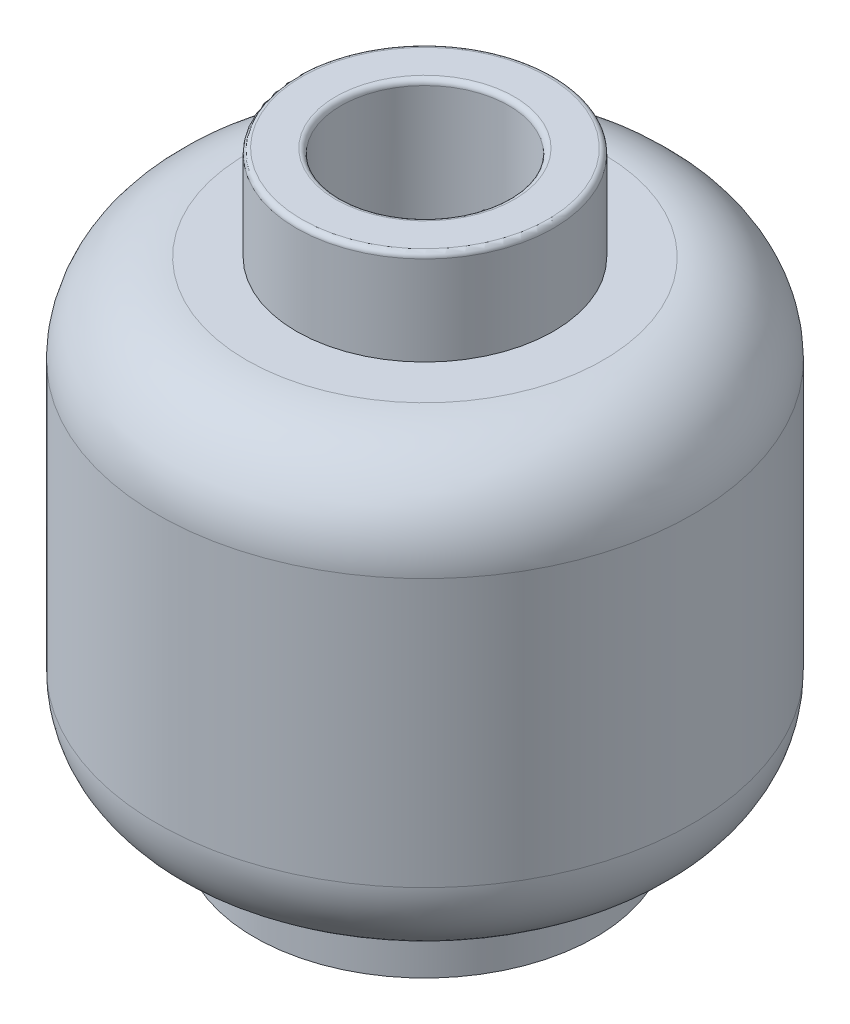
ISO-10303-21;
HEADER;
FILE_DESCRIPTION(('STEP AP214'),'2;1');
FILE_NAME('part.step','',(''),(''),'','','');
FILE_SCHEMA(('AUTOMOTIVE_DESIGN { 1 0 10303 214 1 1 1 1 }'));
ENDSEC;
DATA;
#1=APPLICATION_CONTEXT('core data for automotive mechanical design processes');
#2=APPLICATION_PROTOCOL_DEFINITION('international standard','automotive_design',2000,#1);
#3=PRODUCT_CONTEXT('',#1,'mechanical');
#4=PRODUCT('Part','Part','',(#3));
#5=PRODUCT_RELATED_PRODUCT_CATEGORY('part','',(#4));
#6=PRODUCT_DEFINITION_FORMATION('','',#4);
#7=PRODUCT_DEFINITION_CONTEXT('part definition',#1,'design');
#8=PRODUCT_DEFINITION('design','',#6,#7);
#9=PRODUCT_DEFINITION_SHAPE('','',#8);
#10=(LENGTH_UNIT() NAMED_UNIT(*) SI_UNIT(.MILLI.,.METRE.));
#11=(NAMED_UNIT(*) PLANE_ANGLE_UNIT() SI_UNIT($,.RADIAN.));
#12=(NAMED_UNIT(*) SI_UNIT($,.STERADIAN.) SOLID_ANGLE_UNIT());
#13=UNCERTAINTY_MEASURE_WITH_UNIT(LENGTH_MEASURE(1.E-05),#10,'distance_accuracy_value','');
#14=(GEOMETRIC_REPRESENTATION_CONTEXT(3) GLOBAL_UNCERTAINTY_ASSIGNED_CONTEXT((#13)) GLOBAL_UNIT_ASSIGNED_CONTEXT((#10,
#11,#12)) REPRESENTATION_CONTEXT('',''));
#15=CARTESIAN_POINT('',(0.,0.,0.));
#16=DIRECTION('',(0.,0.,1.));
#17=DIRECTION('',(1.,0.,0.));
#18=AXIS2_PLACEMENT_3D('',#15,#16,#17);
#19=CARTESIAN_POINT('',(0.,0.,0.));
#20=DIRECTION('',(0.,-1.,0.));
#21=DIRECTION('',(0.,0.,-1.));
#22=AXIS2_PLACEMENT_3D('',#19,#20,#21);
#23=CYLINDRICAL_SURFACE('',#22,5.1);
#24=CARTESIAN_POINT('',(1.,5.8,-5.00099990001999));
#25=CARTESIAN_POINT('',(1.00000151690153,5.765488161563,-5.00099990712764));
#26=CARTESIAN_POINT('',(1.00286876052158,5.7309536411149,-5.00042890994423));
#27=CARTESIAN_POINT('',(1.01425646627887,5.66284306685978,-4.99813127779737));
#28=CARTESIAN_POINT('',(1.02278306702181,5.62926809515179,-4.99640338795485));
#29=CARTESIAN_POINT('',(1.04521458875839,5.56407423631433,-4.99175889029626));
#30=CARTESIAN_POINT('',(1.05911613407239,5.53245413587622,-4.98884302851232));
#31=CARTESIAN_POINT('',(1.09185026684241,5.47204175159411,-4.98178100126432));
#32=CARTESIAN_POINT('',(1.11068171939305,5.44324881900771,-4.97763511893192));
#33=CARTESIAN_POINT('',(1.15277623531479,5.38913485922336,-4.96805530875786));
#34=CARTESIAN_POINT('',(1.17605952865221,5.36383062546025,-4.96261547229567));
#35=CARTESIAN_POINT('',(1.22626351158888,5.31750525096138,-4.9504488375796));
#36=CARTESIAN_POINT('',(1.25318449775082,5.29648445978382,-4.94372193437907));
#37=CARTESIAN_POINT('',(1.31032858774834,5.25889309157359,-4.92888668070293));
#38=CARTESIAN_POINT('',(1.34060084855158,5.24240598579846,-4.92075640207097));
#39=CARTESIAN_POINT('',(1.40313946905718,5.21470244708467,-4.90329006920268));
#40=CARTESIAN_POINT('',(1.43540611634181,5.2034867762807,-4.89395384086088));
#41=CARTESIAN_POINT('',(1.50214797051841,5.18619141160312,-4.87389020382693));
#42=CARTESIAN_POINT('',(1.53666096976907,5.18030042707963,-4.86312614436147));
#43=CARTESIAN_POINT('',(1.6058968164829,5.17432566475203,-4.84070457142229));
#44=CARTESIAN_POINT('',(1.64061971138439,5.17424325286651,-4.82904684844376));
#45=CARTESIAN_POINT('',(1.71101143225061,5.17989411128676,-4.80456989248105));
#46=CARTESIAN_POINT('',(1.74664840079208,5.18589992680315,-4.79172183174764));
#47=CARTESIAN_POINT('',(1.81628042291799,5.20390358015892,-4.7657641451245));
#48=CARTESIAN_POINT('',(1.85027501952491,5.215903075283,-4.75265444785392));
#49=CARTESIAN_POINT('',(1.91694272819715,5.24612177724516,-4.72616784257355));
#50=CARTESIAN_POINT('',(1.94952527278676,5.26454782710356,-4.71279811486468));
#51=CARTESIAN_POINT('',(2.01110344261868,5.30710066254025,-4.68685188814152));
#52=CARTESIAN_POINT('',(2.04009866749996,5.33122808354438,-4.67427547774163));
#53=CARTESIAN_POINT('',(2.09319922337433,5.38430308500256,-4.65073651527793));
#54=CARTESIAN_POINT('',(2.1173665136775,5.41317955159165,-4.63975408682706));
#55=CARTESIAN_POINT('',(2.16036994898472,5.47530251745684,-4.61988795561478));
#56=CARTESIAN_POINT('',(2.17920930829465,5.50854636411416,-4.61100298800605));
#57=CARTESIAN_POINT('',(2.20941882839442,5.57566770058096,-4.59659956061495));
#58=CARTESIAN_POINT('',(2.22126265230069,5.60928611707891,-4.59087008544554));
#59=CARTESIAN_POINT('',(2.23908788005507,5.67838137952327,-4.58220318037648));
#60=CARTESIAN_POINT('',(2.24507374341309,5.71385679008005,-4.57926362663521));
#61=CARTESIAN_POINT('',(2.25059255570592,5.78209364732076,-4.57655336681333));
#62=CARTESIAN_POINT('',(2.25067299386433,5.81480129048918,-4.57651380446295));
#63=CARTESIAN_POINT('',(2.24574719214254,5.87973293671201,-4.57893296336695));
#64=CARTESIAN_POINT('',(2.24074178733327,5.91195701828346,-4.58139127448252));
#65=CARTESIAN_POINT('',(2.22608462579069,5.9741098120134,-4.58853031334332));
#66=CARTESIAN_POINT('',(2.21656498636765,6.00407733617531,-4.59314779857097));
#67=CARTESIAN_POINT('',(2.19331529867523,6.06194597288415,-4.60429509999727));
#68=CARTESIAN_POINT('',(2.17958445730978,6.08984669496015,-4.61082527640283));
#69=CARTESIAN_POINT('',(2.14751640124844,6.14446916798602,-4.62585155734728));
#70=CARTESIAN_POINT('',(2.12896763856847,6.17104204151082,-4.63443592664681));
#71=CARTESIAN_POINT('',(2.08827515536961,6.22075425701481,-4.65291370695865));
#72=CARTESIAN_POINT('',(2.06613005649317,6.24389227599294,-4.6628076196059));
#73=CARTESIAN_POINT('',(2.01661947702173,6.28832916512279,-4.68444661193492));
#74=CARTESIAN_POINT('',(1.98896042974994,6.30925906288479,-4.69627827255092));
#75=CARTESIAN_POINT('',(1.93075163098336,6.3461961737034,-4.72050766328082));
#76=CARTESIAN_POINT('',(1.90020077240919,6.36220149142229,-4.73290560923961));
#77=CARTESIAN_POINT('',(1.83468606470461,6.38992287272182,-4.7587025671708));
#78=CARTESIAN_POINT('',(1.79956293002442,6.40125601052133,-4.77211042099349));
#79=CARTESIAN_POINT('',(1.72774336013291,6.41759640939499,-4.79857974928233));
#80=CARTESIAN_POINT('',(1.69104671714969,6.4226028323901,-4.81164117763434));
#81=CARTESIAN_POINT('',(1.61664596965983,6.42606514822672,-4.83714990055694));
#82=CARTESIAN_POINT('',(1.57893511386604,6.42444426832042,-4.84958829808962));
#83=CARTESIAN_POINT('',(1.50407182859973,6.41435083951856,-4.8733262954358));
#84=CARTESIAN_POINT('',(1.46691928529337,6.40587970716359,-4.88462613014563));
#85=CARTESIAN_POINT('',(1.39576310243052,6.38260128501554,-4.9054224592002));
#86=CARTESIAN_POINT('',(1.36169374671174,6.36804124449935,-4.9149703759735));
#87=CARTESIAN_POINT('',(1.29638270127521,6.33292492635012,-4.93259935455761));
#88=CARTESIAN_POINT('',(1.26514011132263,6.3123705665862,-4.94068088419624));
#89=CARTESIAN_POINT('',(1.20800798557652,6.26691704995019,-4.95495150096601));
#90=CARTESIAN_POINT('',(1.1819342574582,6.24227174123747,-4.96121244028701));
#91=CARTESIAN_POINT('',(1.13426011235918,6.1886957942133,-4.97232890416605));
#92=CARTESIAN_POINT('',(1.11265989194766,6.15976496768885,-4.97718436697015));
#93=CARTESIAN_POINT('',(1.07529307207803,6.09944464528376,-4.98538869981984));
#94=CARTESIAN_POINT('',(1.05936427945246,6.06816117676783,-4.9887801739823));
#95=CARTESIAN_POINT('',(1.032954651942,6.00329884162395,-4.99431561319897));
#96=CARTESIAN_POINT('',(1.02246725616904,5.96972279480244,-4.99646108098231));
#97=CARTESIAN_POINT('',(1.00993089238961,5.9132885055672,-4.99900623651242));
#98=CARTESIAN_POINT('',(1.00621232443705,5.89080217040606,-4.99975431794545));
#99=CARTESIAN_POINT('',(1.00124638691545,5.84554718238663,-5.00075114548123));
#100=CARTESIAN_POINT('',(0.999998998813423,5.8227785316469,-5.0009998953288));
#101=CARTESIAN_POINT('',(1.,5.8,-5.00099990001999));
#102=B_SPLINE_CURVE_WITH_KNOTS('',3,(#24,#25,#26,#27,#28,#29,#30,#31,#32,#33,#34,#35,#36,#37,
#38,#39,#40,#41,#42,#43,#44,#45,#46,#47,#48,#49,#50,#51,#52,#53,#54,#55,#56,#57,#58,#59,#60,#61,
#62,#63,#64,#65,#66,#67,#68,#69,#70,#71,#72,#73,#74,#75,#76,#77,#78,#79,#80,#81,#82,#83,#84,#85,
#86,#87,#88,#89,#90,#91,#92,#93,#94,#95,#96,#97,#98,#99,#100,#101),.UNSPECIFIED.,.T.,.F.,(4,2,2,
2,2,2,2,2,2,2,2,2,2,2,2,2,2,2,2,2,2,2,2,2,2,2,2,2,2,2,2,2,2,2,2,2,2,2,4),(0.,0.103452202013909,
0.207016800604948,0.310516461871601,0.413992317580975,0.517950069215874,0.621916301119246,
0.727684988413025,0.833468962855265,0.942869685506748,1.05229613426876,1.16684732578833,
1.28143020887799,1.40010567833363,1.51879438058107,1.63584516059708,1.75282517326617,
1.86053319153262,1.96815915061096,2.06579322859094,2.16341127811561,2.25833377892936,
2.35327416749598,2.4534281003628,2.55362050993002,2.66309505897257,2.77261168925676,
2.88986568072622,3.00713520281728,3.12576703788831,3.24437434775355,3.35857250437301,
3.47273416355636,3.58145331344499,3.69017723951884,3.79547959618473,3.90065468921569,
3.96893580773282,4.03721641416349),.UNSPECIFIED.);
#103=CARTESIAN_POINT('',(1.,5.8,-5.00099990001999));
#104=VERTEX_POINT('',#103);
#105=EDGE_CURVE('E222',#104,#104,#102,.T.);
#106=ORIENTED_EDGE('',*,*,#105,.T.);
#107=EDGE_LOOP('',(#106));
#108=FACE_BOUND('',#107,.T.);
#109=CARTESIAN_POINT('',(0.,7.89999999999999,0.));
#110=DIRECTION('',(0.,-1.,0.));
#111=DIRECTION('',(0.,0.,-1.));
#112=AXIS2_PLACEMENT_3D('',#109,#110,#111);
#113=CIRCLE('',#112,5.1);
#114=CARTESIAN_POINT('',(0.,7.89999999999999,-5.1));
#115=VERTEX_POINT('',#114);
#116=EDGE_CURVE('E201',#115,#115,#113,.T.);
#117=ORIENTED_EDGE('',*,*,#116,.T.);
#118=EDGE_LOOP('',(#117));
#119=FACE_BOUND('',#118,.T.);
#120=CARTESIAN_POINT('',(0.,2.80000000000001,0.));
#121=DIRECTION('',(0.,-1.,0.));
#122=DIRECTION('',(0.,0.,-1.));
#123=AXIS2_PLACEMENT_3D('',#120,#121,#122);
#124=CIRCLE('',#123,5.1);
#125=CARTESIAN_POINT('',(0.,2.80000000000001,-5.1));
#126=VERTEX_POINT('',#125);
#127=EDGE_CURVE('E204',#126,#126,#124,.T.);
#128=ORIENTED_EDGE('',*,*,#127,.F.);
#129=EDGE_LOOP('',(#128));
#130=FACE_BOUND('',#129,.T.);
#131=CARTESIAN_POINT('',(-2.25,5.8,-4.57684389071771));
#132=CARTESIAN_POINT('',(-2.24999821093017,5.76731910036945,-4.57684509570473));
#133=CARTESIAN_POINT('',(-2.24742352409958,5.73461510591976,-4.57811328492607));
#134=CARTESIAN_POINT('',(-2.23723923988095,5.67017253612192,-4.58309842089861));
#135=CARTESIAN_POINT('',(-2.2296236871884,5.63843514917436,-4.58681826402382));
#136=CARTESIAN_POINT('',(-2.20972563417215,5.57692449783731,-4.59643701994647));
#137=CARTESIAN_POINT('',(-2.19745714026951,5.54714565041975,-4.60232939146728));
#138=CARTESIAN_POINT('',(-2.16872735700625,5.49015356934849,-4.61593687371031));
#139=CARTESIAN_POINT('',(-2.15226598984845,5.46294038331251,-4.6236520182532));
#140=CARTESIAN_POINT('',(-2.11478116282377,5.41034270048599,-4.64092079738532));
#141=CARTESIAN_POINT('',(-2.09357355176423,5.38511335026666,-4.65054604251694));
#142=CARTESIAN_POINT('',(-2.04774396214306,5.33850026797738,-4.67090713008831));
#143=CARTESIAN_POINT('',(-2.02312072258144,5.31711796290786,-4.68164338232207));
#144=CARTESIAN_POINT('',(-1.96863294630213,5.27674561146904,-4.70483142166591));
#145=CARTESIAN_POINT('',(-1.93849385989209,5.25816371078624,-4.71734986328975));
#146=CARTESIAN_POINT('',(-1.8756221450062,5.22636637316565,-4.74269871488975));
#147=CARTESIAN_POINT('',(-1.8428885923984,5.21315285877143,-4.75552923488804));
#148=CARTESIAN_POINT('',(-1.77374872752115,5.19182379800837,-4.78176274034261));
#149=CARTESIAN_POINT('',(-1.73723941258804,5.18403073028752,-4.79515812651366));
#150=CARTESIAN_POINT('',(-1.66319810445617,5.17505486753469,-4.82133940079189));
#151=CARTESIAN_POINT('',(-1.62566609584257,5.17387217219489,-4.8341252797041));
#152=CARTESIAN_POINT('',(-1.55088062129565,5.17828782789798,-4.85863237780584));
#153=CARTESIAN_POINT('',(-1.51362678405204,5.18384770352537,-4.87035923138294));
#154=CARTESIAN_POINT('',(-1.44036847775789,5.20170542830229,-4.89252517813363));
#155=CARTESIAN_POINT('',(-1.40436368656999,5.21400152618944,-4.90296460514461));
#156=CARTESIAN_POINT('',(-1.33639539895269,5.24443090822323,-4.92191412051277));
#157=CARTESIAN_POINT('',(-1.30432354450727,5.26228157406131,-4.93048917679626));
#158=CARTESIAN_POINT('',(-1.2435654663394,5.30353267885378,-4.94616317050037));
#159=CARTESIAN_POINT('',(-1.21487835175153,5.32693165258872,-4.95326249671038));
#160=CARTESIAN_POINT('',(-1.16310412919168,5.37747463180253,-4.96566892599652));
#161=CARTESIAN_POINT('',(-1.13982463085653,5.40440565189765,-4.97104172369588));
#162=CARTESIAN_POINT('',(-1.09808908475715,5.46198590135321,-4.98042762525543));
#163=CARTESIAN_POINT('',(-1.07963229089318,5.49263455449922,-4.98444093946394));
#164=CARTESIAN_POINT('',(-1.04858778512332,5.55590315625201,-4.99106302869871));
#165=CARTESIAN_POINT('',(-1.03585885464257,5.58845033223833,-4.99370587652689));
#166=CARTESIAN_POINT('',(-1.01598778237418,5.6552793787839,-4.99778677372652));
#167=CARTESIAN_POINT('',(-1.0088452568402,5.68956113001789,-4.99922490585386));
#168=CARTESIAN_POINT('',(-1.00042397857505,5.75849380100035,-5.00091694997969));
#169=CARTESIAN_POINT('',(-0.999083597488843,5.79313690284205,-5.00118330864447));
#170=CARTESIAN_POINT('',(-1.00214002979624,5.86215840396103,-5.00057173712213));
#171=CARTESIAN_POINT('',(-1.00653668886168,5.89653681033366,-4.99969383771591));
#172=CARTESIAN_POINT('',(-1.02091046741958,5.9639714438645,-4.99677844163824));
#173=CARTESIAN_POINT('',(-1.03087468424415,5.99703053938868,-4.99474362589915));
#174=CARTESIAN_POINT('',(-1.05605752736804,6.06097963475024,-4.98947962611299));
#175=CARTESIAN_POINT('',(-1.07127610288315,6.0918696555486,-4.98625045360954));
#176=CARTESIAN_POINT('',(-1.10654472335407,6.15072806693755,-4.97854239136448));
#177=CARTESIAN_POINT('',(-1.12661116930954,6.17868606754598,-4.97405925097897));
#178=CARTESIAN_POINT('',(-1.1709086224938,6.23080849883774,-4.96381792715512));
#179=CARTESIAN_POINT('',(-1.19513973935135,6.25497282962632,-4.95805971015114));
#180=CARTESIAN_POINT('',(-1.247331635441,6.29917479847546,-4.94518893131065));
#181=CARTESIAN_POINT('',(-1.27533495137311,6.31915752788866,-4.93806045530358));
#182=CARTESIAN_POINT('',(-1.33396784273672,6.35415840439052,-4.92254494847851));
#183=CARTESIAN_POINT('',(-1.36459769549665,6.36917602641298,-4.914157784689));
#184=CARTESIAN_POINT('',(-1.42846052470691,6.39431229924919,-4.89598118116687));
#185=CARTESIAN_POINT('',(-1.46174208100307,6.40428388174009,-4.8861593593167));
#186=CARTESIAN_POINT('',(-1.52918127815087,6.41857313955832,-4.86547524519933));
#187=CARTESIAN_POINT('',(-1.56333910276756,6.42288961888816,-4.85461273335776));
#188=CARTESIAN_POINT('',(-1.63313206050846,6.42596461274787,-4.8315926381899));
#189=CARTESIAN_POINT('',(-1.66876640880608,6.42447155962433,-4.81939917861962));
#190=CARTESIAN_POINT('',(-1.73908614337535,6.41552141304417,-4.79447314128542));
#191=CARTESIAN_POINT('',(-1.77377127564805,6.40806273908869,-4.78174042149958));
#192=CARTESIAN_POINT('',(-1.84282835380547,6.38697161350419,-4.75556578085646));
#193=CARTESIAN_POINT('',(-1.87711962140943,6.37308236969646,-4.74211727490861));
#194=CARTESIAN_POINT('',(-1.94283937523909,6.33941335716951,-4.71557341915411));
#195=CARTESIAN_POINT('',(-1.97426728063138,6.31963239677358,-4.70247814137742));
#196=CARTESIAN_POINT('',(-2.0336243769326,6.27439996519604,-4.67711697517972));
#197=CARTESIAN_POINT('',(-2.06152093769916,6.24890090471902,-4.66485924465042));
#198=CARTESIAN_POINT('',(-2.11255598263187,6.19287213213909,-4.641970605721));
#199=CARTESIAN_POINT('',(-2.13569478139474,6.16234275289574,-4.63133958976979));
#200=CARTESIAN_POINT('',(-2.17509710786169,6.09888732174075,-4.61295998744394));
#201=CARTESIAN_POINT('',(-2.19167582030666,6.06619495935477,-4.60508224522269));
#202=CARTESIAN_POINT('',(-2.2189449995419,5.99798101696466,-4.5920055529927));
#203=CARTESIAN_POINT('',(-2.22964830953976,5.96246580378028,-4.58680076172451));
#204=CARTESIAN_POINT('',(-2.24139677682865,5.90548927883373,-4.58106549185679));
#205=CARTESIAN_POINT('',(-2.24461602880037,5.88455635483225,-4.57948736746911));
#206=CARTESIAN_POINT('',(-2.24891816697547,5.84241885521049,-4.57737620225752));
#207=CARTESIAN_POINT('',(-2.25000116134662,5.8212142933991,-4.57684310851928));
#208=CARTESIAN_POINT('',(-2.25,5.8,-4.57684389071771));
#209=B_SPLINE_CURVE_WITH_KNOTS('',3,(#131,#132,#133,#134,#135,#136,#137,#138,#139,#140,#141,
#142,#143,#144,#145,#146,#147,#148,#149,#150,#151,#152,#153,#154,#155,#156,#157,#158,#159,#160,
#161,#162,#163,#164,#165,#166,#167,#168,#169,#170,#171,#172,#173,#174,#175,#176,#177,#178,#179,
#180,#181,#182,#183,#184,#185,#186,#187,#188,#189,#190,#191,#192,#193,#194,#195,#196,#197,#198,
#199,#200,#201,#202,#203,#204,#205,#206,#207,#208),.UNSPECIFIED.,.T.,.F.,(4,2,2,2,2,2,2,2,2,2,2,
2,2,2,2,2,2,2,2,2,2,2,2,2,2,2,2,2,2,2,2,2,2,2,2,2,2,2,4),(0.,0.0979599375773447,
0.19603581257495,0.293818770289086,0.391603542461189,0.494184159702283,0.596802749499284,
0.708976625992396,0.821190639215509,0.939612702968072,1.05803655265971,1.1757878033801,
1.29350845600906,1.40601578351146,1.51849343265248,1.62596591030116,1.73342175149066,
1.83805966032882,1.94269038065466,2.046206979861,2.14972079449597,2.25299570765941,
2.35626962268268,2.45989794429762,2.56352899419188,2.66844555479928,2.77337320691538,
2.88120449766342,2.9890585899662,3.10163392771462,3.21423910043866,3.33179045133175,
3.4493655946871,3.56795819196073,3.68654294503193,3.79841103740179,3.91003361037509,
3.97362598739754,4.03721514438575),.UNSPECIFIED.);
#210=CARTESIAN_POINT('',(-2.25,5.8,-4.57684389071771));
#211=VERTEX_POINT('',#210);
#212=EDGE_CURVE('E231',#211,#211,#209,.T.);
#213=ORIENTED_EDGE('',*,*,#212,.T.);
#214=EDGE_LOOP('',(#213));
#215=FACE_BOUND('',#214,.T.);
#216=CARTESIAN_POINT('',(1.3,3.8713257982787,-4.93153120237518));
#217=CARTESIAN_POINT('',(1.22883332281746,3.84025830188964,-4.9503010426129));
#218=CARTESIAN_POINT('',(1.15624680790194,3.81162361149582,-4.96777829704287));
#219=CARTESIAN_POINT('',(1.00859894048655,3.75947413134989,-4.99984142214967));
#220=CARTESIAN_POINT('',(0.933536417027163,3.7359618052369,-5.01442590122403));
#221=CARTESIAN_POINT('',(0.78148598086778,3.69437327576793,-5.04035893931483));
#222=CARTESIAN_POINT('',(0.70450116508123,3.6762888715575,-5.05171237863539));
#223=CARTESIAN_POINT('',(0.549036662856893,3.64573002863894,-5.07096725218179));
#224=CARTESIAN_POINT('',(0.470557258612269,3.63325454164576,-5.07886933144565));
#225=CARTESIAN_POINT('',(0.233067920808665,3.60445195955051,-5.09713907659285));
#226=CARTESIAN_POINT('',(0.0724320076051236,3.59686583100802,-5.10199622901578));
#227=CARTESIAN_POINT('',(-0.247805023067229,3.60550042371304,-5.09649602655497));
#228=CARTESIAN_POINT('',(-0.40740644380972,3.62171381838022,-5.08614335394926));
#229=CARTESIAN_POINT('',(-0.691970459008257,3.67186552887662,-5.05447808188846));
#230=CARTESIAN_POINT('',(-0.817889278403212,3.70197996302855,-5.03554107236418));
#231=CARTESIAN_POINT('',(-1.002295936729,3.7577454478594,-5.00093281247279));
#232=CARTESIAN_POINT('',(-1.0630313708364,3.77810476219042,-4.98835976998436));
#233=CARTESIAN_POINT('',(-1.1828190741205,3.82221034597633,-4.9613214198173));
#234=CARTESIAN_POINT('',(-1.24187158850767,3.84595611894727,-4.94685638954605));
#235=CARTESIAN_POINT('',(-1.3,3.8713257982787,-4.93153120237518));
#236=B_SPLINE_CURVE_WITH_KNOTS('',3,(#216,#217,#218,#219,#220,#221,#222,#223,#224,#225,#226,
#227,#228,#229,#230,#231,#232,#233,#234,#235),.UNSPECIFIED.,.F.,.F.,(4,2,2,2,2,2,2,2,2,4),(0.,
0.239627551645458,0.479370100744524,0.718748586582787,0.958082314886314,1.43807358757161,
1.91791712800384,2.30919460846079,2.50491238933672,2.70060150574521),.UNSPECIFIED.);
#237=CARTESIAN_POINT('',(1.3,3.8713257982787,-4.93153120237518));
#238=VERTEX_POINT('',#237);
#239=CARTESIAN_POINT('',(-1.3,3.8713257982787,-4.93153120237518));
#240=VERTEX_POINT('',#239);
#241=EDGE_CURVE('E418',#238,#240,#236,.T.);
#242=ORIENTED_EDGE('',*,*,#241,.T.);
#243=CARTESIAN_POINT('',(-1.3,3.8713257982787,-4.93153120237518));
#244=CARTESIAN_POINT('',(-1.31338855499881,3.87718033566054,-4.92800444988738));
#245=CARTESIAN_POINT('',(-1.32724626058561,3.88182024482468,-4.92429066343492));
#246=CARTESIAN_POINT('',(-1.35546636870045,3.88862283021303,-4.91659613443181));
#247=CARTESIAN_POINT('',(-1.36982807650977,3.89078878821074,-4.91261575296989));
#248=CARTESIAN_POINT('',(-1.39865773341574,3.89261110622255,-4.90448597409676));
#249=CARTESIAN_POINT('',(-1.4131256627602,3.89226792157415,-4.90033660748744));
#250=CARTESIAN_POINT('',(-1.44177342141276,3.88910305721698,-4.8919844258077));
#251=CARTESIAN_POINT('',(-1.45595321387999,3.88628106258507,-4.88778160401288));
#252=CARTESIAN_POINT('',(-1.48383336196229,3.87817520551703,-4.87939070611529));
#253=CARTESIAN_POINT('',(-1.49752408921219,3.87285705856116,-4.87520368095601));
#254=CARTESIAN_POINT('',(-1.52381934455686,3.85987510464736,-4.86704882322635));
#255=CARTESIAN_POINT('',(-1.53642377446825,3.8522110859456,-4.86308101048079));
#256=CARTESIAN_POINT('',(-1.56005869486032,3.83479710124346,-4.85555039134661));
#257=CARTESIAN_POINT('',(-1.57110189506788,3.82506581472958,-4.85198436904747));
#258=CARTESIAN_POINT('',(-1.59137953242917,3.80372219427087,-4.84537151906874));
#259=CARTESIAN_POINT('',(-1.60061443790753,3.79211034879334,-4.842324556986));
#260=CARTESIAN_POINT('',(-1.61661890590952,3.76781348555749,-4.83700443330885));
#261=CARTESIAN_POINT('',(-1.62347112046003,3.75518860898471,-4.83470555898197));
#262=CARTESIAN_POINT('',(-1.63493844688864,3.72885678595348,-4.83083980027428));
#263=CARTESIAN_POINT('',(-1.63955431793703,3.71515020853945,-4.82927266749613));
#264=CARTESIAN_POINT('',(-1.64618855680821,3.68779502151544,-4.82701511754818));
#265=CARTESIAN_POINT('',(-1.64832685359242,3.67417876851477,-4.82628424528599));
#266=CARTESIAN_POINT('',(-1.65033571736966,3.64676167240988,-4.8255977081811));
#267=CARTESIAN_POINT('',(-1.65020676312933,3.63296086889152,-4.82564187967542));
#268=CARTESIAN_POINT('',(-1.6477252597125,3.60600338674792,-4.82648971819857));
#269=CARTESIAN_POINT('',(-1.64543927117247,3.59283978359029,-4.82727065053108));
#270=CARTESIAN_POINT('',(-1.63882421281158,3.56709992221351,-4.82952039869228));
#271=CARTESIAN_POINT('',(-1.6344952194092,3.55452364204491,-4.83098918879168));
#272=CARTESIAN_POINT('',(-1.62389488406982,3.53017429283383,-4.83456273197555));
#273=CARTESIAN_POINT('',(-1.61760564214158,3.51840989886383,-4.83667334131429));
#274=CARTESIAN_POINT('',(-1.60330090717389,3.49609956616153,-4.84143396333915));
#275=CARTESIAN_POINT('',(-1.59528460820921,3.48555419982646,-4.8440842278217));
#276=CARTESIAN_POINT('',(-1.577396735443,3.46550977301499,-4.84993935576414));
#277=CARTESIAN_POINT('',(-1.5674615453281,3.45607299098751,-4.8531627911077));
#278=CARTESIAN_POINT('',(-1.54627268664829,3.43900004721316,-4.85995509838232));
#279=CARTESIAN_POINT('',(-1.5350205086477,3.43136187874333,-4.86352357901116));
#280=CARTESIAN_POINT('',(-1.51570283472007,3.42041152128444,-4.86956970330393));
#281=CARTESIAN_POINT('',(-1.50793574442434,3.41652889421079,-4.87198138359853));
#282=CARTESIAN_POINT('',(-1.5,3.41306822878312,-4.87442304278158));
#283=B_SPLINE_CURVE_WITH_KNOTS('',3,(#243,#244,#245,#246,#247,#248,#249,#250,#251,#252,#253,
#254,#255,#256,#257,#258,#259,#260,#261,#262,#263,#264,#265,#266,#267,#268,#269,#270,#271,#272,
#273,#274,#275,#276,#277,#278,#279,#280,#281,#282),.UNSPECIFIED.,.F.,.F.,(4,2,2,2,2,2,2,2,2,2,2,
2,2,2,2,2,2,2,2,4),(0.,0.045025224234274,0.0899906514813508,0.134947918994098,0.179910898978452,
0.225510371607672,0.271113961365479,0.316321793381832,0.361517901631485,0.404937094277513,
0.448341537088519,0.489543323954973,0.530736410503877,0.570698564779221,0.610659224390692,
0.650996038696503,0.691351716966883,0.733396722969486,0.775394594481899,0.802382153893012),.UNSPECIFIED.);
#284=CARTESIAN_POINT('',(-1.5,3.41306822878312,-4.87442304278158));
#285=VERTEX_POINT('',#284);
#286=EDGE_CURVE('E419',#240,#285,#283,.T.);
#287=ORIENTED_EDGE('',*,*,#286,.T.);
#288=CARTESIAN_POINT('',(-1.5,3.41306822878312,-4.87442304278158));
#289=CARTESIAN_POINT('',(-1.42171111583735,3.37889170926151,-4.89852509576773));
#290=CARTESIAN_POINT('',(-1.34181724284043,3.34721673011557,-4.92103546849376));
#291=CARTESIAN_POINT('',(-1.17918027380885,3.28917431201682,-4.96251508266952));
#292=CARTESIAN_POINT('',(-1.09643556604906,3.26280993505584,-4.98148228073741));
#293=CARTESIAN_POINT('',(-0.928691413283697,3.21577325453837,-5.01546028898561));
#294=CARTESIAN_POINT('',(-0.843696042509262,3.19509134613128,-5.03047777334927));
#295=CARTESIAN_POINT('',(-0.671891405161058,3.15963842856894,-5.05629548084032));
#296=CARTESIAN_POINT('',(-0.58508252471386,3.14486617437761,-5.0670965922545));
#297=CARTESIAN_POINT('',(-0.322020414935065,3.10966758036194,-5.09286764925101));
#298=CARTESIAN_POINT('',(-0.143710326781214,3.09852317260773,-5.10108581460206));
#299=CARTESIAN_POINT('',(0.212531719749159,3.10179259294817,-5.09868200709709));
#300=CARTESIAN_POINT('',(0.390463710698506,3.11620412196602,-5.08806172899513));
#301=CARTESIAN_POINT('',(0.646868174337704,3.15528636506579,-5.05948124901694));
#302=CARTESIAN_POINT('',(0.727745782312023,3.17037824361878,-5.04846237222024));
#303=CARTESIAN_POINT('',(0.887814645185861,3.20569081035253,-5.02278206437061));
#304=CARTESIAN_POINT('',(0.967005711783128,3.2259120680078,-5.00812022887239));
#305=CARTESIAN_POINT('',(1.12331926272737,3.27127309936233,-4.97539325638981));
#306=CARTESIAN_POINT('',(1.2004396624433,3.29641763288984,-4.95732482653838));
#307=CARTESIAN_POINT('',(1.35217257207851,3.35133657062295,-4.91810786104882));
#308=CARTESIAN_POINT('',(1.42678614434309,3.38110898274077,-4.8969606509304));
#309=CARTESIAN_POINT('',(1.5,3.41306822878312,-4.87442304278158));
#310=B_SPLINE_CURVE_WITH_KNOTS('',3,(#288,#289,#290,#291,#292,#293,#294,#295,#296,#297,#298,
#299,#300,#301,#302,#303,#304,#305,#306,#307,#308,#309),.UNSPECIFIED.,.F.,.F.,(4,2,2,2,2,2,2,2,
2,2,4),(0.,0.26624128090769,0.532635634792653,0.798576903404741,1.06446211441134,
1.59804745986537,2.13158480506541,2.38040259459032,2.62924802049213,2.87833522904931,
3.12731551248963),.UNSPECIFIED.);
#311=CARTESIAN_POINT('',(1.5,3.41306822878312,-4.87442304278158));
#312=VERTEX_POINT('',#311);
#313=EDGE_CURVE('E428',#285,#312,#310,.T.);
#314=ORIENTED_EDGE('',*,*,#313,.T.);
#315=CARTESIAN_POINT('',(1.5,3.41306822878312,-4.87442304278158));
#316=CARTESIAN_POINT('',(1.5129921297973,3.41872797621861,-4.87042647700853));
#317=CARTESIAN_POINT('',(1.52552108280501,3.42552100838913,-4.86651258710401));
#318=CARTESIAN_POINT('',(1.54932769864021,3.44119114912756,-4.85898508494261));
#319=CARTESIAN_POINT('',(1.56060351336927,3.45007127716384,-4.85537191810472));
#320=CARTESIAN_POINT('',(1.58155415075106,3.46972964236222,-4.84858836714601));
#321=CARTESIAN_POINT('',(1.59122664692254,3.48051059171787,-4.84541862747843));
#322=CARTESIAN_POINT('',(1.60861725374694,3.50367541479481,-4.83967295771278));
#323=CARTESIAN_POINT('',(1.61633714568872,3.51605781187236,-4.83709648659144));
#324=CARTESIAN_POINT('',(1.62930927016676,3.54162156011827,-4.83274215638999));
#325=CARTESIAN_POINT('',(1.63463900560651,3.55475926626187,-4.83093931226276));
#326=CARTESIAN_POINT('',(1.64301397305429,3.58182531592822,-4.82809743846653));
#327=CARTESIAN_POINT('',(1.6460593341948,3.595753614712,-4.82705836562269));
#328=CARTESIAN_POINT('',(1.64965255091778,3.62329388433362,-4.82583152188237));
#329=CARTESIAN_POINT('',(1.65031147297281,3.63688976992827,-4.82560589505975));
#330=CARTESIAN_POINT('',(1.64941642212929,3.66399761603801,-4.82591190366103));
#331=CARTESIAN_POINT('',(1.64786293329277,3.67750959426192,-4.82644337343682));
#332=CARTESIAN_POINT('',(1.64265106147291,3.70381779668502,-4.82821962734615));
#333=CARTESIAN_POINT('',(1.63903082179037,3.71662250006249,-4.82945148373099));
#334=CARTESIAN_POINT('',(1.62984348345589,3.74142890775111,-4.83255973427093));
#335=CARTESIAN_POINT('',(1.6242761931526,3.75343053287538,-4.83443619187485));
#336=CARTESIAN_POINT('',(1.61123718259941,3.77658145311768,-4.83879766287342));
#337=CARTESIAN_POINT('',(1.6037266708742,3.78770652939705,-4.84129502587946));
#338=CARTESIAN_POINT('',(1.58709834426103,3.80854613164405,-4.84677164001422));
#339=CARTESIAN_POINT('',(1.57798019953009,3.81826036739785,-4.84975099002331));
#340=CARTESIAN_POINT('',(1.55793480121915,3.83648685827367,-4.85622847198912));
#341=CARTESIAN_POINT('',(1.54694290714674,3.84492170532959,-4.85974434367049));
#342=CARTESIAN_POINT('',(1.52378795261249,3.85983502418409,-4.86705430680834));
#343=CARTESIAN_POINT('',(1.51162467396208,3.86631313057618,-4.87084845006574));
#344=CARTESIAN_POINT('',(1.48587322620604,3.87742277183669,-4.87876726905277));
#345=CARTESIAN_POINT('',(1.47224551093709,3.88195767251258,-4.88289913359837));
#346=CARTESIAN_POINT('',(1.44442131310073,3.88863472170274,-4.89120208531174));
#347=CARTESIAN_POINT('',(1.43022456409287,3.89077573543653,-4.89537319013677));
#348=CARTESIAN_POINT('',(1.40132967157461,3.89262173416028,-4.90372374430571));
#349=CARTESIAN_POINT('',(1.38662740840622,3.89227130149411,-4.90790130341179));
#350=CARTESIAN_POINT('',(1.35747461120597,3.88898831890365,-4.91604414182277));
#351=CARTESIAN_POINT('',(1.34302371099097,3.8860599145751,-4.92000975110565));
#352=CARTESIAN_POINT('',(1.31908480283208,3.87896407769676,-4.92647159555257));
#353=CARTESIAN_POINT('',(1.30942297520727,3.87544347115936,-4.9290481812043));
#354=CARTESIAN_POINT('',(1.3,3.8713257982787,-4.93153120237518));
#355=B_SPLINE_CURVE_WITH_KNOTS('',3,(#315,#316,#317,#318,#319,#320,#321,#322,#323,#324,#325,
#326,#327,#328,#329,#330,#331,#332,#333,#334,#335,#336,#337,#338,#339,#340,#341,#342,#343,#344,
#345,#346,#347,#348,#349,#350,#351,#352,#353,#354),.UNSPECIFIED.,.F.,.F.,(4,2,2,2,2,2,2,2,2,2,2,
2,2,2,2,2,2,2,2,4),(0.,0.0441307820895509,0.0883258069237412,0.132584409583137,
0.176802489931182,0.219459345299822,0.262113789154474,0.302755545660831,0.343388411364318,
0.383294551691399,0.423204621150356,0.463982825863061,0.504769406921777,0.547462459164341,
0.590163479088739,0.634793428562676,0.679444525130616,0.725091861653775,0.770665927225258,
0.802392571483399),.UNSPECIFIED.);
#356=EDGE_CURVE('E422',#312,#238,#355,.T.);
#357=ORIENTED_EDGE('',*,*,#356,.T.);
#358=EDGE_LOOP('',(#242,#287,#314,#357));
#359=FACE_BOUND('',#358,.T.);
#360=ADVANCED_FACE('F37',(#108,#119,#130,#215,#359),#23,.T.);
#361=ORIENTED_EDGE('',*,*,#286,.F.);
#362=ORIENTED_EDGE('',*,*,#241,.F.);
#363=ORIENTED_EDGE('',*,*,#356,.F.);
#364=ORIENTED_EDGE('',*,*,#313,.F.);
#365=EDGE_LOOP('',(#361,#362,#363,#364));
#366=FACE_BOUND('',#365,.T.);
#367=ADVANCED_FACE('F314',(#366),#23,.T.);
#368=ORIENTED_EDGE('',*,*,#212,.F.);
#369=EDGE_LOOP('',(#368));
#370=FACE_BOUND('',#369,.T.);
#371=ADVANCED_FACE('F244',(#370),#23,.T.);
#372=CARTESIAN_POINT('',(0.,8.5,0.));
#373=DIRECTION('',(0.,-1.,0.));
#374=DIRECTION('',(0.,0.,-1.));
#375=AXIS2_PLACEMENT_3D('',#372,#373,#374);
#376=PLANE('',#375);
#377=DIRECTION('',(0.866025403784436,0.,0.500000000000004));
#378=VECTOR('',#377,1.);
#379=CARTESIAN_POINT('',(0.42,8.5,-0.242487113059642));
#380=LINE('',#379,#378);
#381=CARTESIAN_POINT('',(0.42,8.5,-0.242487113059642));
#382=VERTEX_POINT('',#381);
#383=CARTESIAN_POINT('',(1.54704898937922,8.5,0.408214924348355));
#384=VERTEX_POINT('',#383);
#385=EDGE_CURVE('E132',#382,#384,#380,.T.);
#386=ORIENTED_EDGE('',*,*,#385,.T.);
#387=CARTESIAN_POINT('',(0.,8.5,0.));
#388=DIRECTION('',(0.,-1.,0.));
#389=DIRECTION('',(0.,0.,-1.));
#390=AXIS2_PLACEMENT_3D('',#387,#388,#389);
#391=CIRCLE('',#390,1.6);
#392=CARTESIAN_POINT('',(0.42,8.5,-1.54389118787562));
#393=VERTEX_POINT('',#392);
#394=EDGE_CURVE('E118',#384,#393,#391,.F.);
#395=ORIENTED_EDGE('',*,*,#394,.T.);
#396=DIRECTION('',(0.,0.,1.));
#397=VECTOR('',#396,1.);
#398=CARTESIAN_POINT('',(0.42,8.5,-1.54389118787562));
#399=LINE('',#398,#397);
#400=EDGE_CURVE('E140',#393,#382,#399,.T.);
#401=ORIENTED_EDGE('',*,*,#400,.T.);
#402=EDGE_LOOP('',(#386,#395,#401));
#403=FACE_BOUND('',#402,.T.);
#404=DIRECTION('',(-0.866025403784443,0.,0.499999999999992));
#405=VECTOR('',#404,1.);
#406=CARTESIAN_POINT('',(0.,8.5,0.484974226119285));
#407=LINE('',#406,#405);
#408=CARTESIAN_POINT('',(0.,8.5,0.484974226119285));
#409=VERTEX_POINT('',#408);
#410=CARTESIAN_POINT('',(-1.12704898937923,8.5,1.13567626352726));
#411=VERTEX_POINT('',#410);
#412=EDGE_CURVE('E153',#409,#411,#407,.T.);
#413=ORIENTED_EDGE('',*,*,#412,.T.);
#414=CARTESIAN_POINT('',(0.,8.5,0.));
#415=DIRECTION('',(0.,-1.,0.));
#416=DIRECTION('',(0.,0.,-1.));
#417=AXIS2_PLACEMENT_3D('',#414,#415,#416);
#418=CIRCLE('',#417,1.6);
#419=CARTESIAN_POINT('',(1.12704898937922,8.5,1.13567626352728));
#420=VERTEX_POINT('',#419);
#421=EDGE_CURVE('E143',#411,#420,#418,.F.);
#422=ORIENTED_EDGE('',*,*,#421,.T.);
#423=DIRECTION('',(-0.866025403784437,0.,-0.500000000000004));
#424=VECTOR('',#423,1.);
#425=CARTESIAN_POINT('',(1.12704898937922,8.5,1.13567626352728));
#426=LINE('',#425,#424);
#427=EDGE_CURVE('E150',#420,#409,#426,.T.);
#428=ORIENTED_EDGE('',*,*,#427,.T.);
#429=EDGE_LOOP('',(#413,#422,#428));
#430=FACE_BOUND('',#429,.T.);
#431=DIRECTION('',(0.,0.,-1.));
#432=VECTOR('',#431,1.);
#433=CARTESIAN_POINT('',(-0.42,8.5,-0.242487113059642));
#434=LINE('',#433,#432);
#435=CARTESIAN_POINT('',(-0.42,8.5,-0.242487113059642));
#436=VERTEX_POINT('',#435);
#437=CARTESIAN_POINT('',(-0.419999999999999,8.5,-1.54389118787562));
#438=VERTEX_POINT('',#437);
#439=EDGE_CURVE('E171',#436,#438,#434,.T.);
#440=ORIENTED_EDGE('',*,*,#439,.T.);
#441=CARTESIAN_POINT('',(0.,8.5,0.));
#442=DIRECTION('',(0.,-1.,0.));
#443=DIRECTION('',(0.,0.,-1.));
#444=AXIS2_PLACEMENT_3D('',#441,#442,#443);
#445=CIRCLE('',#444,1.6);
#446=CARTESIAN_POINT('',(-1.54704898937922,8.5,0.408214924348354));
#447=VERTEX_POINT('',#446);
#448=EDGE_CURVE('E183',#438,#447,#445,.F.);
#449=ORIENTED_EDGE('',*,*,#448,.T.);
#450=DIRECTION('',(0.866025403784436,0.,-0.500000000000004));
#451=VECTOR('',#450,1.);
#452=CARTESIAN_POINT('',(-1.54704898937922,8.5,0.408214924348355));
#453=LINE('',#452,#451);
#454=EDGE_CURVE('E127',#447,#436,#453,.T.);
#455=ORIENTED_EDGE('',*,*,#454,.T.);
#456=EDGE_LOOP('',(#440,#449,#455));
#457=FACE_BOUND('',#456,.T.);
#458=CARTESIAN_POINT('',(0.,8.5,0.));
#459=DIRECTION('',(0.,-1.,0.));
#460=DIRECTION('',(0.,0.,-1.));
#461=AXIS2_PLACEMENT_3D('',#458,#459,#460);
#462=CIRCLE('',#461,2.45);
#463=CARTESIAN_POINT('',(0.,8.5,-2.45));
#464=VERTEX_POINT('',#463);
#465=EDGE_CURVE('E219',#464,#464,#462,.T.);
#466=ORIENTED_EDGE('',*,*,#465,.T.);
#467=EDGE_LOOP('',(#466));
#468=FACE_BOUND('',#467,.T.);
#469=ADVANCED_FACE('F138',(#403,#430,#457,#468),#376,.T.);
#470=CARTESIAN_POINT('',(0.,0.,0.));
#471=DIRECTION('',(0.,-1.,0.));
#472=DIRECTION('',(0.,0.,-1.));
#473=AXIS2_PLACEMENT_3D('',#470,#471,#472);
#474=CYLINDRICAL_SURFACE('',#473,2.45);
#475=CARTESIAN_POINT('',(0.,0.,0.));
#476=DIRECTION('',(0.,-1.,0.));
#477=DIRECTION('',(0.,0.,-1.));
#478=AXIS2_PLACEMENT_3D('',#475,#476,#477);
#479=CIRCLE('',#478,2.45);
#480=CARTESIAN_POINT('',(0.,0.,-2.45));
#481=VERTEX_POINT('',#480);
#482=EDGE_CURVE('E216',#481,#481,#479,.T.);
#483=ORIENTED_EDGE('',*,*,#482,.T.);
#484=EDGE_LOOP('',(#483));
#485=FACE_BOUND('',#484,.T.);
#486=ORIENTED_EDGE('',*,*,#465,.F.);
#487=EDGE_LOOP('',(#486));
#488=FACE_BOUND('',#487,.T.);
#489=ADVANCED_FACE('F243',(#485,#488),#474,.F.);
#490=CARTESIAN_POINT('',(0.,0.,-2.45));
#491=DIRECTION('',(0.,-1.,0.));
#492=DIRECTION('',(0.,0.,-1.));
#493=AXIS2_PLACEMENT_3D('',#490,#491,#492);
#494=PLANE('',#493);
#495=CARTESIAN_POINT('',(0.,0.,0.));
#496=DIRECTION('',(0.,-1.,0.));
#497=DIRECTION('',(0.,0.,-1.));
#498=AXIS2_PLACEMENT_3D('',#495,#496,#497);
#499=CIRCLE('',#498,3.25);
#500=CARTESIAN_POINT('',(0.,0.,-3.25));
#501=VERTEX_POINT('',#500);
#502=EDGE_CURVE('E213',#501,#501,#499,.T.);
#503=ORIENTED_EDGE('',*,*,#502,.T.);
#504=EDGE_LOOP('',(#503));
#505=FACE_BOUND('',#504,.T.);
#506=ORIENTED_EDGE('',*,*,#482,.F.);
#507=EDGE_LOOP('',(#506));
#508=FACE_BOUND('',#507,.T.);
#509=ADVANCED_FACE('F247',(#505,#508),#494,.T.);
#510=CARTESIAN_POINT('',(0.,0.,0.));
#511=DIRECTION('',(0.,-1.,0.));
#512=DIRECTION('',(0.,0.,-1.));
#513=AXIS2_PLACEMENT_3D('',#510,#511,#512);
#514=CYLINDRICAL_SURFACE('',#513,3.25);
#515=CARTESIAN_POINT('',(0.,1.1,0.));
#516=DIRECTION('',(0.,-1.,0.));
#517=DIRECTION('',(0.,0.,-1.));
#518=AXIS2_PLACEMENT_3D('',#515,#516,#517);
#519=CIRCLE('',#518,3.25);
#520=CARTESIAN_POINT('',(0.,1.1,-3.25));
#521=VERTEX_POINT('',#520);
#522=EDGE_CURVE('E210',#521,#521,#519,.T.);
#523=ORIENTED_EDGE('',*,*,#522,.T.);
#524=EDGE_LOOP('',(#523));
#525=FACE_BOUND('',#524,.T.);
#526=ORIENTED_EDGE('',*,*,#502,.F.);
#527=EDGE_LOOP('',(#526));
#528=FACE_BOUND('',#527,.T.);
#529=ADVANCED_FACE('F251',(#525,#528),#514,.T.);
#530=CARTESIAN_POINT('',(0.,1.1,-3.25));
#531=DIRECTION('',(0.,-1.,0.));
#532=DIRECTION('',(0.,0.,-1.));
#533=AXIS2_PLACEMENT_3D('',#530,#531,#532);
#534=PLANE('',#533);
#535=CARTESIAN_POINT('',(0.,1.1,0.));
#536=DIRECTION('',(0.,-1.,0.));
#537=DIRECTION('',(0.,0.,-1.));
#538=AXIS2_PLACEMENT_3D('',#535,#536,#537);
#539=CIRCLE('',#538,3.39999999999999);
#540=CARTESIAN_POINT('',(0.,1.1,-3.39999999999999));
#541=VERTEX_POINT('',#540);
#542=EDGE_CURVE('E207',#541,#541,#539,.T.);
#543=ORIENTED_EDGE('',*,*,#542,.T.);
#544=EDGE_LOOP('',(#543));
#545=FACE_BOUND('',#544,.T.);
#546=ORIENTED_EDGE('',*,*,#522,.F.);
#547=EDGE_LOOP('',(#546));
#548=FACE_BOUND('',#547,.T.);
#549=ADVANCED_FACE('F255',(#545,#548),#534,.T.);
#550=CARTESIAN_POINT('',(0.,2.8,0.));
#551=DIRECTION('',(0.,-1.,0.));
#552=DIRECTION('',(0.,0.,-1.));
#553=AXIS2_PLACEMENT_3D('',#550,#551,#552);
#554=TOROIDAL_SURFACE('',#553,3.4,1.7);
#555=ORIENTED_EDGE('',*,*,#127,.T.);
#556=EDGE_LOOP('',(#555));
#557=FACE_BOUND('',#556,.T.);
#558=ORIENTED_EDGE('',*,*,#542,.F.);
#559=EDGE_LOOP('',(#558));
#560=FACE_BOUND('',#559,.T.);
#561=ADVANCED_FACE('F259',(#557,#560),#554,.T.);
#562=ORIENTED_EDGE('',*,*,#105,.F.);
#563=EDGE_LOOP('',(#562));
#564=FACE_BOUND('',#563,.T.);
#565=ADVANCED_FACE('F237',(#564),#23,.T.);
#566=CARTESIAN_POINT('',(0.,7.9,0.));
#567=DIRECTION('',(0.,-1.,0.));
#568=DIRECTION('',(0.,0.,-1.));
#569=AXIS2_PLACEMENT_3D('',#566,#567,#568);
#570=TOROIDAL_SURFACE('',#569,3.4,1.7);
#571=CARTESIAN_POINT('',(0.,9.6,0.));
#572=DIRECTION('',(0.,-1.,0.));
#573=DIRECTION('',(0.,0.,-1.));
#574=AXIS2_PLACEMENT_3D('',#571,#572,#573);
#575=CIRCLE('',#574,3.39999999999999);
#576=CARTESIAN_POINT('',(0.,9.6,-3.39999999999999));
#577=VERTEX_POINT('',#576);
#578=EDGE_CURVE('E198',#577,#577,#575,.T.);
#579=ORIENTED_EDGE('',*,*,#578,.T.);
#580=EDGE_LOOP('',(#579));
#581=FACE_BOUND('',#580,.T.);
#582=ORIENTED_EDGE('',*,*,#116,.F.);
#583=EDGE_LOOP('',(#582));
#584=FACE_BOUND('',#583,.T.);
#585=ADVANCED_FACE('F264',(#581,#584),#570,.T.);
#586=CARTESIAN_POINT('',(0.,9.6,-3.39999999999999));
#587=DIRECTION('',(0.,1.,0.));
#588=DIRECTION('',(0.,0.,1.));
#589=AXIS2_PLACEMENT_3D('',#586,#587,#588);
#590=PLANE('',#589);
#591=CARTESIAN_POINT('',(0.,9.6,0.));
#592=DIRECTION('',(0.,-1.,0.));
#593=DIRECTION('',(0.,0.,-1.));
#594=AXIS2_PLACEMENT_3D('',#591,#592,#593);
#595=CIRCLE('',#594,2.45);
#596=CARTESIAN_POINT('',(0.,9.6,-2.45));
#597=VERTEX_POINT('',#596);
#598=EDGE_CURVE('E194',#597,#597,#595,.T.);
#599=ORIENTED_EDGE('',*,*,#598,.T.);
#600=EDGE_LOOP('',(#599));
#601=FACE_BOUND('',#600,.T.);
#602=ORIENTED_EDGE('',*,*,#578,.F.);
#603=EDGE_LOOP('',(#602));
#604=FACE_BOUND('',#603,.T.);
#605=ADVANCED_FACE('F267',(#601,#604),#590,.T.);
#606=CARTESIAN_POINT('',(0.,0.,0.));
#607=DIRECTION('',(0.,-1.,0.));
#608=DIRECTION('',(0.,0.,-1.));
#609=AXIS2_PLACEMENT_3D('',#606,#607,#608);
#610=CYLINDRICAL_SURFACE('',#609,2.45);
#611=CARTESIAN_POINT('',(0.,11.3,0.));
#612=DIRECTION('',(0.,1.,0.));
#613=DIRECTION('',(0.,0.,1.));
#614=AXIS2_PLACEMENT_3D('',#611,#612,#613);
#615=CIRCLE('',#614,2.45);
#616=CARTESIAN_POINT('',(0.,11.3,2.45));
#617=VERTEX_POINT('',#616);
#618=EDGE_CURVE('E11',#617,#617,#615,.F.);
#619=ORIENTED_EDGE('',*,*,#618,.T.);
#620=EDGE_LOOP('',(#619));
#621=FACE_BOUND('',#620,.T.);
#622=ORIENTED_EDGE('',*,*,#598,.F.);
#623=EDGE_LOOP('',(#622));
#624=FACE_BOUND('',#623,.T.);
#625=ADVANCED_FACE('F271',(#621,#624),#610,.T.);
#626=CARTESIAN_POINT('',(0.,11.4,-2.45));
#627=DIRECTION('',(0.,1.,0.));
#628=DIRECTION('',(0.,0.,1.));
#629=AXIS2_PLACEMENT_3D('',#626,#627,#628);
#630=PLANE('',#629);
#631=CARTESIAN_POINT('',(0.,11.4,0.));
#632=DIRECTION('',(0.,1.,0.));
#633=DIRECTION('',(0.,0.,1.));
#634=AXIS2_PLACEMENT_3D('',#631,#632,#633);
#635=CIRCLE('',#634,1.7);
#636=CARTESIAN_POINT('',(0.,11.4,1.7));
#637=VERTEX_POINT('',#636);
#638=EDGE_CURVE('E45',#637,#637,#635,.F.);
#639=ORIENTED_EDGE('',*,*,#638,.T.);
#640=EDGE_LOOP('',(#639));
#641=FACE_BOUND('',#640,.T.);
#642=CARTESIAN_POINT('',(0.,11.4,0.));
#643=DIRECTION('',(0.,1.,0.));
#644=DIRECTION('',(0.,0.,1.));
#645=AXIS2_PLACEMENT_3D('',#642,#643,#644);
#646=CIRCLE('',#645,2.35);
#647=CARTESIAN_POINT('',(0.,11.4,2.35));
#648=VERTEX_POINT('',#647);
#649=EDGE_CURVE('E402',#648,#648,#646,.T.);
#650=ORIENTED_EDGE('',*,*,#649,.T.);
#651=EDGE_LOOP('',(#650));
#652=FACE_BOUND('',#651,.T.);
#653=ADVANCED_FACE('F275',(#641,#652),#630,.T.);
#654=CARTESIAN_POINT('',(0.,9.4,0.));
#655=DIRECTION('',(0.,1.,0.));
#656=DIRECTION('',(0.,0.,1.));
#657=AXIS2_PLACEMENT_3D('',#654,#655,#656);
#658=CYLINDRICAL_SURFACE('',#657,1.6);
#659=CARTESIAN_POINT('',(0.,11.3,0.));
#660=DIRECTION('',(0.,1.,0.));
#661=DIRECTION('',(0.,0.,1.));
#662=AXIS2_PLACEMENT_3D('',#659,#660,#661);
#663=CIRCLE('',#662,1.6);
#664=CARTESIAN_POINT('',(0.,11.3,1.6));
#665=VERTEX_POINT('',#664);
#666=EDGE_CURVE('E459',#665,#665,#663,.T.);
#667=ORIENTED_EDGE('',*,*,#666,.T.);
#668=EDGE_LOOP('',(#667));
#669=FACE_BOUND('',#668,.T.);
#670=CARTESIAN_POINT('',(0.,9.4,0.));
#671=DIRECTION('',(0.,1.,0.));
#672=DIRECTION('',(0.,0.,1.));
#673=AXIS2_PLACEMENT_3D('',#670,#671,#672);
#674=CIRCLE('',#673,1.6);
#675=CARTESIAN_POINT('',(-1.54704898937922,9.4,0.408214924348354));
#676=VERTEX_POINT('',#675);
#677=CARTESIAN_POINT('',(-1.12704898937923,9.4,1.13567626352726));
#678=VERTEX_POINT('',#677);
#679=EDGE_CURVE('E191',#676,#678,#674,.T.);
#680=ORIENTED_EDGE('',*,*,#679,.F.);
#681=DIRECTION('',(0.,1.,0.));
#682=VECTOR('',#681,1.);
#683=CARTESIAN_POINT('',(-1.54704898937922,-0.000999999999999265,0.408214924348355));
#684=LINE('',#683,#682);
#685=EDGE_CURVE('E184',#447,#676,#684,.T.);
#686=ORIENTED_EDGE('',*,*,#685,.F.);
#687=ORIENTED_EDGE('',*,*,#448,.F.);
#688=DIRECTION('',(0.,1.,0.));
#689=VECTOR('',#688,1.);
#690=CARTESIAN_POINT('',(-0.419999999999999,-0.000999999999999265,-1.54389118787562));
#691=LINE('',#690,#689);
#692=CARTESIAN_POINT('',(-0.419999999999999,9.4,-1.54389118787562));
#693=VERTEX_POINT('',#692);
#694=EDGE_CURVE('E180',#438,#693,#691,.T.);
#695=ORIENTED_EDGE('',*,*,#694,.T.);
#696=CARTESIAN_POINT('',(0.42,9.4,-1.54389118787562));
#697=VERTEX_POINT('',#696);
#698=EDGE_CURVE('E190',#697,#693,#674,.T.);
#699=ORIENTED_EDGE('',*,*,#698,.F.);
#700=DIRECTION('',(0.,1.,0.));
#701=VECTOR('',#700,1.);
#702=CARTESIAN_POINT('',(0.42,-0.000999999999999265,-1.54389118787562));
#703=LINE('',#702,#701);
#704=EDGE_CURVE('E52',#393,#697,#703,.T.);
#705=ORIENTED_EDGE('',*,*,#704,.F.);
#706=ORIENTED_EDGE('',*,*,#394,.F.);
#707=DIRECTION('',(0.,1.,0.));
#708=VECTOR('',#707,1.);
#709=CARTESIAN_POINT('',(1.54704898937922,-0.000999999999999265,0.408214924348355));
#710=LINE('',#709,#708);
#711=CARTESIAN_POINT('',(1.54704898937922,9.4,0.408214924348355));
#712=VERTEX_POINT('',#711);
#713=EDGE_CURVE('E122',#384,#712,#710,.T.);
#714=ORIENTED_EDGE('',*,*,#713,.T.);
#715=CARTESIAN_POINT('',(1.12704898937922,9.4,1.13567626352728));
#716=VERTEX_POINT('',#715);
#717=EDGE_CURVE('E195',#716,#712,#674,.T.);
#718=ORIENTED_EDGE('',*,*,#717,.F.);
#719=DIRECTION('',(0.,1.,0.));
#720=VECTOR('',#719,1.);
#721=CARTESIAN_POINT('',(1.12704898937922,-0.000999999999999265,1.13567626352728));
#722=LINE('',#721,#720);
#723=EDGE_CURVE('E59',#420,#716,#722,.T.);
#724=ORIENTED_EDGE('',*,*,#723,.F.);
#725=ORIENTED_EDGE('',*,*,#421,.F.);
#726=DIRECTION('',(0.,1.,0.));
#727=VECTOR('',#726,1.);
#728=CARTESIAN_POINT('',(-1.12704898937923,-0.000999999999999265,1.13567626352726));
#729=LINE('',#728,#727);
#730=EDGE_CURVE('E161',#411,#678,#729,.T.);
#731=ORIENTED_EDGE('',*,*,#730,.T.);
#732=EDGE_LOOP('',(#680,#686,#687,#695,#699,#705,#706,#714,#718,#724,#725,#731));
#733=FACE_BOUND('',#732,.T.);
#734=ADVANCED_FACE('F121',(#669,#733),#658,.F.);
#735=CARTESIAN_POINT('',(0.,9.4,0.));
#736=DIRECTION('',(0.,1.,0.));
#737=DIRECTION('',(0.,0.,1.));
#738=AXIS2_PLACEMENT_3D('',#735,#736,#737);
#739=PLANE('',#738);
#740=DIRECTION('',(0.866025403784436,0.,0.500000000000004));
#741=VECTOR('',#740,1.);
#742=CARTESIAN_POINT('',(0.42,9.4,-0.242487113059642));
#743=LINE('',#742,#741);
#744=CARTESIAN_POINT('',(0.42,9.4,-0.242487113059642));
#745=VERTEX_POINT('',#744);
#746=EDGE_CURVE('E135',#745,#712,#743,.T.);
#747=ORIENTED_EDGE('',*,*,#746,.F.);
#748=DIRECTION('',(0.,0.,1.));
#749=VECTOR('',#748,1.);
#750=CARTESIAN_POINT('',(0.42,9.4,-1.54389118787562));
#751=LINE('',#750,#749);
#752=EDGE_CURVE('E136',#697,#745,#751,.T.);
#753=ORIENTED_EDGE('',*,*,#752,.F.);
#754=ORIENTED_EDGE('',*,*,#698,.T.);
#755=DIRECTION('',(0.,0.,-1.));
#756=VECTOR('',#755,1.);
#757=CARTESIAN_POINT('',(-0.42,9.4,-0.242487113059642));
#758=LINE('',#757,#756);
#759=CARTESIAN_POINT('',(-0.42,9.4,-0.242487113059642));
#760=VERTEX_POINT('',#759);
#761=EDGE_CURVE('E174',#760,#693,#758,.T.);
#762=ORIENTED_EDGE('',*,*,#761,.F.);
#763=DIRECTION('',(0.866025403784436,0.,-0.500000000000004));
#764=VECTOR('',#763,1.);
#765=CARTESIAN_POINT('',(-1.54704898937922,9.4,0.408214924348355));
#766=LINE('',#765,#764);
#767=EDGE_CURVE('E177',#676,#760,#766,.T.);
#768=ORIENTED_EDGE('',*,*,#767,.F.);
#769=ORIENTED_EDGE('',*,*,#679,.T.);
#770=DIRECTION('',(-0.866025403784443,0.,0.499999999999992));
#771=VECTOR('',#770,1.);
#772=CARTESIAN_POINT('',(0.,9.4,0.484974226119285));
#773=LINE('',#772,#771);
#774=CARTESIAN_POINT('',(0.,9.4,0.484974226119285));
#775=VERTEX_POINT('',#774);
#776=EDGE_CURVE('E156',#775,#678,#773,.T.);
#777=ORIENTED_EDGE('',*,*,#776,.F.);
#778=DIRECTION('',(-0.866025403784436,0.,-0.500000000000004));
#779=VECTOR('',#778,1.);
#780=CARTESIAN_POINT('',(1.12704898937922,9.4,1.13567626352728));
#781=LINE('',#780,#779);
#782=EDGE_CURVE('E158',#716,#775,#781,.T.);
#783=ORIENTED_EDGE('',*,*,#782,.F.);
#784=ORIENTED_EDGE('',*,*,#717,.T.);
#785=EDGE_LOOP('',(#747,#753,#754,#762,#768,#769,#777,#783,#784));
#786=FACE_BOUND('',#785,.T.);
#787=ADVANCED_FACE('F282',(#786),#739,.T.);
#788=CARTESIAN_POINT('',(-0.42,-0.000999999999999265,-0.242487113059642));
#789=DIRECTION('',(1.,0.,0.));
#790=DIRECTION('',(0.,0.,-1.));
#791=AXIS2_PLACEMENT_3D('',#788,#789,#790);
#792=PLANE('',#791);
#793=DIRECTION('',(0.,1.,0.));
#794=VECTOR('',#793,1.);
#795=CARTESIAN_POINT('',(-0.42,-0.000999999999999265,-0.242487113059642));
#796=LINE('',#795,#794);
#797=EDGE_CURVE('E181',#436,#760,#796,.T.);
#798=ORIENTED_EDGE('',*,*,#797,.T.);
#799=ORIENTED_EDGE('',*,*,#761,.T.);
#800=ORIENTED_EDGE('',*,*,#694,.F.);
#801=ORIENTED_EDGE('',*,*,#439,.F.);
#802=EDGE_LOOP('',(#798,#799,#800,#801));
#803=FACE_BOUND('',#802,.T.);
#804=ADVANCED_FACE('F286',(#803),#792,.F.);
#805=CARTESIAN_POINT('',(-1.54704898937922,-0.000999999999999265,0.408214924348355));
#806=DIRECTION('',(0.500000000000004,0.,0.866025403784436));
#807=DIRECTION('',(0.866025403784436,0.,-0.500000000000004));
#808=AXIS2_PLACEMENT_3D('',#805,#806,#807);
#809=PLANE('',#808);
#810=ORIENTED_EDGE('',*,*,#685,.T.);
#811=ORIENTED_EDGE('',*,*,#767,.T.);
#812=ORIENTED_EDGE('',*,*,#797,.F.);
#813=ORIENTED_EDGE('',*,*,#454,.F.);
#814=EDGE_LOOP('',(#810,#811,#812,#813));
#815=FACE_BOUND('',#814,.T.);
#816=ADVANCED_FACE('F290',(#815),#809,.F.);
#817=CARTESIAN_POINT('',(0.,-0.000999999999999265,0.484974226119285));
#818=DIRECTION('',(-0.499999999999992,0.,-0.866025403784443));
#819=DIRECTION('',(-0.866025403784443,0.,0.499999999999992));
#820=AXIS2_PLACEMENT_3D('',#817,#818,#819);
#821=PLANE('',#820);
#822=DIRECTION('',(0.,1.,0.));
#823=VECTOR('',#822,1.);
#824=CARTESIAN_POINT('',(0.,-0.000999999999999265,0.484974226119285));
#825=LINE('',#824,#823);
#826=EDGE_CURVE('E162',#409,#775,#825,.T.);
#827=ORIENTED_EDGE('',*,*,#826,.T.);
#828=ORIENTED_EDGE('',*,*,#776,.T.);
#829=ORIENTED_EDGE('',*,*,#730,.F.);
#830=ORIENTED_EDGE('',*,*,#412,.F.);
#831=EDGE_LOOP('',(#827,#828,#829,#830));
#832=FACE_BOUND('',#831,.T.);
#833=ADVANCED_FACE('F294',(#832),#821,.F.);
#834=CARTESIAN_POINT('',(1.12704898937922,-0.000999999999999265,1.13567626352728));
#835=DIRECTION('',(0.500000000000004,0.,-0.866025403784437));
#836=DIRECTION('',(-0.866025403784437,0.,-0.500000000000004));
#837=AXIS2_PLACEMENT_3D('',#834,#835,#836);
#838=PLANE('',#837);
#839=ORIENTED_EDGE('',*,*,#723,.T.);
#840=ORIENTED_EDGE('',*,*,#782,.T.);
#841=ORIENTED_EDGE('',*,*,#826,.F.);
#842=ORIENTED_EDGE('',*,*,#427,.F.);
#843=EDGE_LOOP('',(#839,#840,#841,#842));
#844=FACE_BOUND('',#843,.T.);
#845=ADVANCED_FACE('F298',(#844),#838,.F.);
#846=CARTESIAN_POINT('',(0.42,-0.000999999999999265,-0.242487113059642));
#847=DIRECTION('',(-0.500000000000004,0.,0.866025403784436));
#848=DIRECTION('',(0.866025403784436,0.,0.500000000000004));
#849=AXIS2_PLACEMENT_3D('',#846,#847,#848);
#850=PLANE('',#849);
#851=DIRECTION('',(0.,1.,0.));
#852=VECTOR('',#851,1.);
#853=CARTESIAN_POINT('',(0.42,-0.000999999999999265,-0.242487113059642));
#854=LINE('',#853,#852);
#855=EDGE_CURVE('E128',#382,#745,#854,.T.);
#856=ORIENTED_EDGE('',*,*,#855,.T.);
#857=ORIENTED_EDGE('',*,*,#746,.T.);
#858=ORIENTED_EDGE('',*,*,#713,.F.);
#859=ORIENTED_EDGE('',*,*,#385,.F.);
#860=EDGE_LOOP('',(#856,#857,#858,#859));
#861=FACE_BOUND('',#860,.T.);
#862=ADVANCED_FACE('F131',(#861),#850,.F.);
#863=CARTESIAN_POINT('',(0.42,-0.000999999999999265,-1.54389118787562));
#864=DIRECTION('',(-1.,0.,0.));
#865=DIRECTION('',(0.,0.,1.));
#866=AXIS2_PLACEMENT_3D('',#863,#864,#865);
#867=PLANE('',#866);
#868=ORIENTED_EDGE('',*,*,#704,.T.);
#869=ORIENTED_EDGE('',*,*,#752,.T.);
#870=ORIENTED_EDGE('',*,*,#855,.F.);
#871=ORIENTED_EDGE('',*,*,#400,.F.);
#872=EDGE_LOOP('',(#868,#869,#870,#871));
#873=FACE_BOUND('',#872,.T.);
#874=ADVANCED_FACE('F305',(#873),#867,.F.);
#875=CARTESIAN_POINT('',(0.,11.3,0.));
#876=DIRECTION('',(0.,1.,0.));
#877=DIRECTION('',(0.,0.,1.));
#878=AXIS2_PLACEMENT_3D('',#875,#876,#877);
#879=TOROIDAL_SURFACE('',#878,1.7,0.1);
#880=ORIENTED_EDGE('',*,*,#638,.F.);
#881=EDGE_LOOP('',(#880));
#882=FACE_BOUND('',#881,.T.);
#883=ORIENTED_EDGE('',*,*,#666,.F.);
#884=EDGE_LOOP('',(#883));
#885=FACE_BOUND('',#884,.T.);
#886=ADVANCED_FACE('F307',(#882,#885),#879,.T.);
#887=CARTESIAN_POINT('',(0.,11.3,0.));
#888=DIRECTION('',(0.,1.,0.));
#889=DIRECTION('',(0.,0.,1.));
#890=AXIS2_PLACEMENT_3D('',#887,#888,#889);
#891=TOROIDAL_SURFACE('',#890,2.35,0.1);
#892=ORIENTED_EDGE('',*,*,#649,.F.);
#893=EDGE_LOOP('',(#892));
#894=FACE_BOUND('',#893,.T.);
#895=ORIENTED_EDGE('',*,*,#618,.F.);
#896=EDGE_LOOP('',(#895));
#897=FACE_BOUND('',#896,.T.);
#898=ADVANCED_FACE('F39',(#894,#897),#891,.T.);
#899=CLOSED_SHELL('',(#360,#367,#371,#469,#489,#509,#529,#549,#561,#565,#585,#605,#625,#653,
#734,#787,#804,#816,#833,#845,#862,#874,#886,#898));
#900=MANIFOLD_SOLID_BREP('B2',#899);
#901=ADVANCED_BREP_SHAPE_REPRESENTATION('',(#18,#900),#14);
#902=SHAPE_DEFINITION_REPRESENTATION(#9,#901);
ENDSEC;
END-ISO-10303-21;
